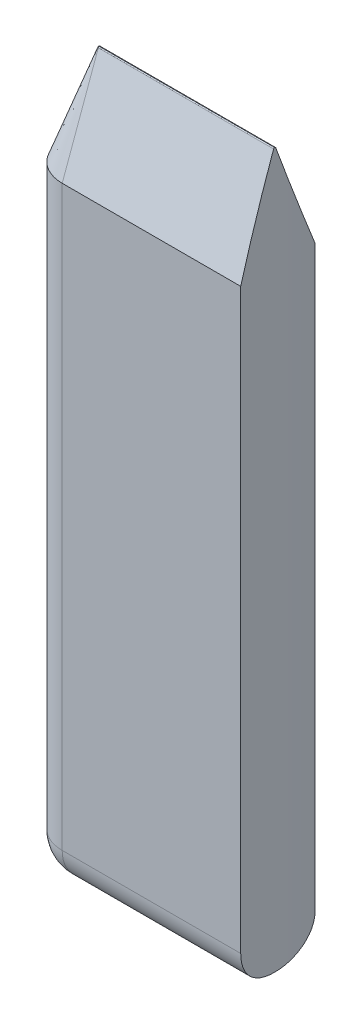
ISO-10303-21;
HEADER;
FILE_DESCRIPTION(('STEP AP214'),'2;1');
FILE_NAME('part.step','',(''),(''),'','','');
FILE_SCHEMA(('AUTOMOTIVE_DESIGN { 1 0 10303 214 1 1 1 1 }'));
ENDSEC;
DATA;
#1=APPLICATION_CONTEXT('core data for automotive mechanical design processes');
#2=APPLICATION_PROTOCOL_DEFINITION('international standard','automotive_design',2000,#1);
#3=PRODUCT_CONTEXT('',#1,'mechanical');
#4=PRODUCT('Part','Part','',(#3));
#5=PRODUCT_RELATED_PRODUCT_CATEGORY('part','',(#4));
#6=PRODUCT_DEFINITION_FORMATION('','',#4);
#7=PRODUCT_DEFINITION_CONTEXT('part definition',#1,'design');
#8=PRODUCT_DEFINITION('design','',#6,#7);
#9=PRODUCT_DEFINITION_SHAPE('','',#8);
#10=(LENGTH_UNIT() NAMED_UNIT(*) SI_UNIT(.MILLI.,.METRE.));
#11=(NAMED_UNIT(*) PLANE_ANGLE_UNIT() SI_UNIT($,.RADIAN.));
#12=(NAMED_UNIT(*) SI_UNIT($,.STERADIAN.) SOLID_ANGLE_UNIT());
#13=UNCERTAINTY_MEASURE_WITH_UNIT(LENGTH_MEASURE(1.E-05),#10,'distance_accuracy_value','');
#14=(GEOMETRIC_REPRESENTATION_CONTEXT(3) GLOBAL_UNCERTAINTY_ASSIGNED_CONTEXT((#13)) GLOBAL_UNIT_ASSIGNED_CONTEXT((#10,
#11,#12)) REPRESENTATION_CONTEXT('',''));
#15=CARTESIAN_POINT('',(0.,0.,0.));
#16=DIRECTION('',(0.,0.,1.));
#17=DIRECTION('',(1.,0.,0.));
#18=AXIS2_PLACEMENT_3D('',#15,#16,#17);
#19=CARTESIAN_POINT('',(0.,100.,-5.20944533000771));
#20=DIRECTION('',(0.,0.,1.));
#21=DIRECTION('',(1.,0.,0.));
#22=AXIS2_PLACEMENT_3D('',#19,#20,#21);
#23=PLANE('',#22);
#24=DIRECTION('',(0.,-1.,0.));
#25=VECTOR('',#24,1.);
#26=CARTESIAN_POINT('',(-29.5442325903663,100.,-5.2094453300077));
#27=LINE('',#26,#25);
#28=CARTESIAN_POINT('',(-29.5442325903663,85.9999999999999,-5.2094453300077));
#29=VERTEX_POINT('',#28);
#30=CARTESIAN_POINT('',(-29.5442325903663,5.09999999999999,-5.2094453300077));
#31=VERTEX_POINT('',#30);
#32=EDGE_CURVE('E125',#29,#31,#27,.T.);
#33=ORIENTED_EDGE('',*,*,#32,.T.);
#34=DIRECTION('',(-1.,0.,0.));
#35=VECTOR('',#34,1.);
#36=CARTESIAN_POINT('',(0.,5.09999999999999,-5.20944533000771));
#37=LINE('',#36,#35);
#38=CARTESIAN_POINT('',(-54.5442325903663,5.09999999999999,-5.2094453300077));
#39=VERTEX_POINT('',#38);
#40=EDGE_CURVE('E11',#31,#39,#37,.T.);
#41=ORIENTED_EDGE('',*,*,#40,.T.);
#42=DIRECTION('',(0.,-1.,0.));
#43=VECTOR('',#42,1.);
#44=CARTESIAN_POINT('',(-54.5442325903663,100.,-5.2094453300077));
#45=LINE('',#44,#43);
#46=CARTESIAN_POINT('',(-54.5442325903663,85.9999999999999,-5.2094453300077));
#47=VERTEX_POINT('',#46);
#48=EDGE_CURVE('E126',#47,#39,#45,.T.);
#49=ORIENTED_EDGE('',*,*,#48,.F.);
#50=DIRECTION('',(1.,0.,0.));
#51=VECTOR('',#50,1.);
#52=CARTESIAN_POINT('',(-29.5442325903663,85.9999999999999,-5.2094453300077));
#53=LINE('',#52,#51);
#54=EDGE_CURVE('E123',#47,#29,#53,.T.);
#55=ORIENTED_EDGE('',*,*,#54,.T.);
#56=EDGE_LOOP('',(#33,#41,#49,#55));
#57=FACE_BOUND('',#56,.T.);
#58=ADVANCED_FACE('F43',(#57),#23,.F.);
#59=CARTESIAN_POINT('',(-54.5442325903663,100.,2.19442519711066E-13));
#60=DIRECTION('',(0.,-1.,0.));
#61=DIRECTION('',(0.,0.,-1.));
#62=AXIS2_PLACEMENT_3D('',#59,#60,#61);
#63=CYLINDRICAL_SURFACE('',#62,5.20944533000792);
#64=ORIENTED_EDGE('',*,*,#48,.T.);
#65=CARTESIAN_POINT('',(-54.5442325903663,5.09999999999999,2.19442519711066E-13));
#66=DIRECTION('',(0.,1.,0.));
#67=DIRECTION('',(0.,0.,1.));
#68=AXIS2_PLACEMENT_3D('',#65,#66,#67);
#69=CIRCLE('',#68,5.20944533000792);
#70=CARTESIAN_POINT('',(-54.5442325903663,5.09999999999999,5.20944533000814));
#71=VERTEX_POINT('',#70);
#72=EDGE_CURVE('E54',#39,#71,#69,.T.);
#73=ORIENTED_EDGE('',*,*,#72,.T.);
#74=DIRECTION('',(0.,-1.,0.));
#75=VECTOR('',#74,1.);
#76=CARTESIAN_POINT('',(-54.5442325903663,100.,5.20944533000814));
#77=LINE('',#76,#75);
#78=CARTESIAN_POINT('',(-54.5442325903663,85.9999999999999,5.20944533000814));
#79=VERTEX_POINT('',#78);
#80=EDGE_CURVE('E157',#79,#71,#77,.T.);
#81=ORIENTED_EDGE('',*,*,#80,.F.);
#82=CARTESIAN_POINT('',(-54.5442325903663,85.9999999999999,2.19442519711066E-13));
#83=DIRECTION('',(0.,1.,0.));
#84=DIRECTION('',(0.,0.,1.));
#85=AXIS2_PLACEMENT_3D('',#82,#83,#84);
#86=CIRCLE('',#85,5.20944533000792);
#87=EDGE_CURVE('E132',#79,#47,#86,.F.);
#88=ORIENTED_EDGE('',*,*,#87,.T.);
#89=EDGE_LOOP('',(#64,#73,#81,#88));
#90=FACE_BOUND('',#89,.T.);
#91=ADVANCED_FACE('F299',(#90),#63,.T.);
#92=CARTESIAN_POINT('',(0.,100.,5.20944533000814));
#93=DIRECTION('',(0.,0.,-1.));
#94=DIRECTION('',(-1.,0.,0.));
#95=AXIS2_PLACEMENT_3D('',#92,#93,#94);
#96=PLANE('',#95);
#97=ORIENTED_EDGE('',*,*,#80,.T.);
#98=DIRECTION('',(1.,0.,0.));
#99=VECTOR('',#98,1.);
#100=CARTESIAN_POINT('',(0.,5.09999999999999,5.20944533000814));
#101=LINE('',#100,#99);
#102=CARTESIAN_POINT('',(-29.5442325903662,5.09999999999999,5.20944533000814));
#103=VERTEX_POINT('',#102);
#104=EDGE_CURVE('E263',#71,#103,#101,.T.);
#105=ORIENTED_EDGE('',*,*,#104,.T.);
#106=DIRECTION('',(0.,-1.,0.));
#107=VECTOR('',#106,1.);
#108=CARTESIAN_POINT('',(-29.5442325903662,100.,5.20944533000814));
#109=LINE('',#108,#107);
#110=CARTESIAN_POINT('',(-29.5442325903662,85.9999999999999,5.20944533000814));
#111=VERTEX_POINT('',#110);
#112=EDGE_CURVE('E144',#111,#103,#109,.T.);
#113=ORIENTED_EDGE('',*,*,#112,.F.);
#114=DIRECTION('',(-1.,0.,0.));
#115=VECTOR('',#114,1.);
#116=CARTESIAN_POINT('',(-54.5442325903663,85.9999999999999,5.20944533000814));
#117=LINE('',#116,#115);
#118=EDGE_CURVE('E155',#111,#79,#117,.T.);
#119=ORIENTED_EDGE('',*,*,#118,.T.);
#120=EDGE_LOOP('',(#97,#105,#113,#119));
#121=FACE_BOUND('',#120,.T.);
#122=ADVANCED_FACE('F304',(#121),#96,.F.);
#123=CARTESIAN_POINT('',(0.,100.,0.));
#124=DIRECTION('',(0.,-1.,0.));
#125=DIRECTION('',(0.,0.,-1.));
#126=AXIS2_PLACEMENT_3D('',#123,#124,#125);
#127=CYLINDRICAL_SURFACE('',#126,30.);
#128=ORIENTED_EDGE('',*,*,#112,.T.);
#129=CARTESIAN_POINT('',(-29.5442325903662,5.09999999999999,5.20944533000814));
#130=CARTESIAN_POINT('',(-29.5442218325108,4.9577174742323,5.2094619453206));
#131=CARTESIAN_POINT('',(-29.5452821125208,4.81543877875373,5.20349183932434));
#132=CARTESIAN_POINT('',(-29.549466738831,4.53192074410002,5.17969929964654));
#133=CARTESIAN_POINT('',(-29.5525908700081,4.3906812981511,5.16187810124962));
#134=CARTESIAN_POINT('',(-29.5608195584034,4.11043617542221,5.11453701388363));
#135=CARTESIAN_POINT('',(-29.5659213866775,3.97142769428515,5.08503324402277));
#136=CARTESIAN_POINT('',(-29.577956073752,3.69643079101989,5.01455877518684));
#137=CARTESIAN_POINT('',(-29.58488893216,3.5604423682444,4.97358807866953));
#138=CARTESIAN_POINT('',(-29.6003897453926,3.29243515995644,4.88048660443796));
#139=CARTESIAN_POINT('',(-29.6089577335196,3.16041645535807,4.82835559942067));
#140=CARTESIAN_POINT('',(-29.6274909261284,2.90121498667138,4.71329783142563));
#141=CARTESIAN_POINT('',(-29.6374566452518,2.77403402585634,4.65036709008976));
#142=CARTESIAN_POINT('',(-29.6585022261715,2.52546590176804,4.5141984490243));
#143=CARTESIAN_POINT('',(-29.6695817319161,2.40407690512149,4.44096384022972));
#144=CARTESIAN_POINT('',(-29.6925566863038,2.16782573751628,4.28466063123084));
#145=CARTESIAN_POINT('',(-29.7044524205444,2.05296587706432,4.20158858145978));
#146=CARTESIAN_POINT('',(-29.7288442800312,1.82956121045432,4.02539409242482));
#147=CARTESIAN_POINT('',(-29.7413449318481,1.721084441918,3.93218600113604));
#148=CARTESIAN_POINT('',(-29.7664995492098,1.5123476137697,3.73700204068212));
#149=CARTESIAN_POINT('',(-29.7791535155875,1.41208759882309,3.63502612386222));
#150=CARTESIAN_POINT('',(-29.8042733454019,1.2204359284725,3.42296534237359));
#151=CARTESIAN_POINT('',(-29.8167391381917,1.12904753712346,3.31287751917298));
#152=CARTESIAN_POINT('',(-29.8411340302005,0.955844851381717,3.08541670883883));
#153=CARTESIAN_POINT('',(-29.8530633143957,0.874027241375479,2.96804626632305));
#154=CARTESIAN_POINT('',(-29.8761511016307,0.719937533184893,2.72589314236945));
#155=CARTESIAN_POINT('',(-29.8873032506017,0.64774051851732,2.60106205529978));
#156=CARTESIAN_POINT('',(-29.9084281473089,0.514163299124288,2.34570523169869));
#157=CARTESIAN_POINT('',(-29.9184013296827,0.452779104032281,2.2151816182181));
#158=CARTESIAN_POINT('',(-29.9368960035573,0.341272623658434,1.94935691070488));
#159=CARTESIAN_POINT('',(-29.9454180059798,0.291146372765552,1.81405751843492));
#160=CARTESIAN_POINT('',(-29.9607797685641,0.202524937433703,1.5396670063071));
#161=CARTESIAN_POINT('',(-29.9676199373074,0.164026927531619,1.40057681651759));
#162=CARTESIAN_POINT('',(-29.9814470220937,0.0878512704453816,1.07159214291683));
#163=CARTESIAN_POINT('',(-29.9876900942969,0.0549209829009383,0.880532352718219));
#164=CARTESIAN_POINT('',(-29.994308612837,0.0219789119984413,0.592221230109305));
#165=CARTESIAN_POINT('',(-29.9960569805275,0.0137404558155837,0.495862461108339));
#166=CARTESIAN_POINT('',(-29.9986269127672,0.00275162314080604,0.302826804598548));
#167=CARTESIAN_POINT('',(-29.9994485408976,8.70141480275351E-07,0.206149939369973));
#168=CARTESIAN_POINT('',(-29.9998003613314,0.,0.109445330008141));
#169=B_SPLINE_CURVE_WITH_KNOTS('',3,(#129,#130,#131,#132,#133,#134,#135,#136,#137,#138,#139,
#140,#141,#142,#143,#144,#145,#146,#147,#148,#149,#150,#151,#152,#153,#154,#155,#156,#157,#158,
#159,#160,#161,#162,#163,#164,#165,#166,#167,#168),.UNSPECIFIED.,.F.,.F.,(4,2,2,2,2,2,2,2,2,2,2,
2,2,2,2,2,2,2,2,4),(0.,0.426712728252777,0.853380985577793,1.27946258438274,1.70554409186355,
2.13163427821183,2.55788176399363,2.9839934190473,3.41025493803148,3.8404490530832,
4.2706455064672,4.70099964292111,5.13120424712493,5.56459102140884,5.99781752188233,
6.43089117813037,6.86385952009873,7.44432654293333,7.73437010370512,8.02439376411038),.UNSPECIFIED.);
#170=CARTESIAN_POINT('',(-29.9998003613314,0.,0.109445330008139));
#171=VERTEX_POINT('',#170);
#172=EDGE_CURVE('E219',#103,#171,#169,.T.);
#173=ORIENTED_EDGE('',*,*,#172,.T.);
#174=CARTESIAN_POINT('',(0.,0.,0.));
#175=DIRECTION('',(0.,1.,0.));
#176=DIRECTION('',(0.,0.,1.));
#177=AXIS2_PLACEMENT_3D('',#174,#175,#176);
#178=CIRCLE('',#177,30.);
#179=CARTESIAN_POINT('',(-29.9998003613314,0.,-0.109445330007705));
#180=VERTEX_POINT('',#179);
#181=EDGE_CURVE('E174',#180,#171,#178,.T.);
#182=ORIENTED_EDGE('',*,*,#181,.F.);
#183=CARTESIAN_POINT('',(-29.9998003613314,0.,-0.109445330007705));
#184=CARTESIAN_POINT('',(-29.9992909401964,-1.65254190717098E-05,-0.251855665726624));
#185=CARTESIAN_POINT('',(-29.9977476020564,0.00596419409722868,-0.394258369641108));
#186=CARTESIAN_POINT('',(-29.992670178993,0.0297977857413274,-0.67801700959861));
#187=CARTESIAN_POINT('',(-29.9891362974598,0.0476494449510309,-0.819373051092931));
#188=CARTESIAN_POINT('',(-29.9801607791786,0.0950707140583756,-1.09984763665828));
#189=CARTESIAN_POINT('',(-29.9747217146443,0.124624531693326,-1.23896893434017));
#190=CARTESIAN_POINT('',(-29.9620796122686,0.195217637693757,-1.51418320432871));
#191=CARTESIAN_POINT('',(-29.9548765753155,0.236256920275695,-1.65027617816024));
#192=CARTESIAN_POINT('',(-29.9388955966588,0.329514062067432,-1.91848481299129));
#193=CARTESIAN_POINT('',(-29.930117606993,0.381732261719539,-2.05060035272237));
#194=CARTESIAN_POINT('',(-29.9112167295176,0.496982157714836,-2.30998502423049));
#195=CARTESIAN_POINT('',(-29.9010933465608,0.560017837731348,-2.43725234941727));
#196=CARTESIAN_POINT('',(-29.8797772782473,0.696412692491037,-2.68597976906648));
#197=CARTESIAN_POINT('',(-29.8685849439679,0.769768481503683,-2.8074417506561));
#198=CARTESIAN_POINT('',(-29.8454224765661,0.926329814032865,-3.04382458961479));
#199=CARTESIAN_POINT('',(-29.8334520714422,1.0095388105248,-3.15874313287328));
#200=CARTESIAN_POINT('',(-29.8089492283203,1.18598594231188,-3.38220238070389));
#201=CARTESIAN_POINT('',(-29.7964127694212,1.27930593908105,-3.49067801317504));
#202=CARTESIAN_POINT('',(-29.7712191051377,1.47471956465638,-3.69940076659518));
#203=CARTESIAN_POINT('',(-29.7585618991593,1.57681323663289,-3.79964784705133));
#204=CARTESIAN_POINT('',(-29.7334689871696,1.78911475723911,-3.99126102594164));
#205=CARTESIAN_POINT('',(-29.7210333647576,1.89932559105435,-4.08262382812333));
#206=CARTESIAN_POINT('',(-29.6967361553563,2.12703602948195,-4.2557612226739));
#207=CARTESIAN_POINT('',(-29.6848743698717,2.24453308116801,-4.33753914466739));
#208=CARTESIAN_POINT('',(-29.6619725800038,2.48687345566946,-4.49149010150039));
#209=CARTESIAN_POINT('',(-29.6509387361704,2.61176143998997,-4.56359378064336));
#210=CARTESIAN_POINT('',(-29.6301017667406,2.86722633371635,-4.69698054784637));
#211=CARTESIAN_POINT('',(-29.6202981859573,2.99780111482538,-4.75826764138209));
#212=CARTESIAN_POINT('',(-29.6022029326121,3.26372006013375,-4.8695753807062));
#213=CARTESIAN_POINT('',(-29.5939107103002,3.39906246866777,-4.91960012468842));
#214=CARTESIAN_POINT('',(-29.5790768924416,3.67353076690956,-5.00801480392936));
#215=CARTESIAN_POINT('',(-29.5725348677222,3.8126557198503,-5.04640759181073));
#216=CARTESIAN_POINT('',(-29.5595194279071,4.14107315558337,-5.12218625415215));
#217=CARTESIAN_POINT('',(-29.5538082870597,4.33150893982478,-5.15489549298873));
#218=CARTESIAN_POINT('',(-29.5480751839355,4.6188606739643,-5.18761552690795));
#219=CARTESIAN_POINT('',(-29.5466364253479,4.71489599503232,-5.19579822716794));
#220=CARTESIAN_POINT('',(-29.544714633877,4.90727897140723,-5.20671252747314));
#221=CARTESIAN_POINT('',(-29.5442315368755,5.00362660532567,-5.20944449322428));
#222=CARTESIAN_POINT('',(-29.5442325903663,5.09999999999999,-5.2094453300077));
#223=B_SPLINE_CURVE_WITH_KNOTS('',3,(#183,#184,#185,#186,#187,#188,#189,#190,#191,#192,#193,
#194,#195,#196,#197,#198,#199,#200,#201,#202,#203,#204,#205,#206,#207,#208,#209,#210,#211,#212,
#213,#214,#215,#216,#217,#218,#219,#220,#221,#222),.UNSPECIFIED.,.F.,.F.,(4,2,2,2,2,2,2,2,2,2,2,
2,2,2,2,2,2,2,2,4),(0.,0.427098804861374,0.854153977432398,1.28063478529898,1.70711537841021,
2.13360896139303,2.56025994438086,2.98677128046827,3.4134325287593,3.84385082508393,
4.27427123937711,4.70485074413717,5.13528022676222,5.56864711258198,6.00185318061568,
6.43490135599194,6.8678432444445,7.44631691237875,7.73536525273406,8.02439419932722),.UNSPECIFIED.);
#224=EDGE_CURVE('E142',#180,#31,#223,.T.);
#225=ORIENTED_EDGE('',*,*,#224,.T.);
#226=ORIENTED_EDGE('',*,*,#32,.F.);
#227=CARTESIAN_POINT('',(0.,100.312833412079,0.));
#228=DIRECTION('',(0.,0.342020143325666,-0.939692620785909));
#229=DIRECTION('',(0.,-0.939692620785909,-0.342020143325666));
#230=AXIS2_PLACEMENT_3D('',#227,#228,#229);
#231=ELLIPSE('',#230,87.7141320048932,30.);
#232=CARTESIAN_POINT('',(-29.9996260728345,99.9013030214989,-0.149784812667292));
#233=VERTEX_POINT('',#232);
#234=EDGE_CURVE('E138',#29,#233,#231,.T.);
#235=ORIENTED_EDGE('',*,*,#234,.T.);
#236=CARTESIAN_POINT('',(-29.9996260728345,99.9013030214989,-0.149784812667294));
#237=CARTESIAN_POINT('',(-29.9996404036884,99.9092349175894,-0.146905482667805));
#238=CARTESIAN_POINT('',(-29.9996578161423,99.9169165091503,-0.143344678941403));
#239=CARTESIAN_POINT('',(-29.9996965870593,99.9315716215033,-0.134991815411371));
#240=CARTESIAN_POINT('',(-29.9997179428105,99.9385456238379,-0.130200600898598));
#241=CARTESIAN_POINT('',(-29.9997624177129,99.9515921318218,-0.119512167977807));
#242=CARTESIAN_POINT('',(-29.999785537567,99.9576642752809,-0.113614507357039));
#243=CARTESIAN_POINT('',(-29.9998310466726,99.9687318425656,-0.100884314640802));
#244=CARTESIAN_POINT('',(-29.9998534360084,99.9737273911216,-0.0940518909936573));
#245=CARTESIAN_POINT('',(-29.9998951443222,99.9825016932101,-0.0796440994051266));
#246=CARTESIAN_POINT('',(-29.9999144624305,99.986280102378,-0.0720685219930863));
#247=CARTESIAN_POINT('',(-29.9999480227497,99.9925100523478,-0.0563906533110948));
#248=CARTESIAN_POINT('',(-29.9999622672004,99.9949621789003,-0.0482885963338741));
#249=CARTESIAN_POINT('',(-29.9999801256876,99.9978084643646,-0.0349125292666395));
#250=CARTESIAN_POINT('',(-29.9999857227793,99.9986300674486,-0.029725600830425));
#251=CARTESIAN_POINT('',(-29.9999942451135,99.9997255852973,-0.0193034901910599));
#252=CARTESIAN_POINT('',(-29.9999971750538,100.000000464041,-0.0140684092982567));
#253=CARTESIAN_POINT('',(-29.9999987002476,100.,-0.00883091954947934));
#254=B_SPLINE_CURVE_WITH_KNOTS('',3,(#236,#237,#238,#239,#240,#241,#242,#243,#244,#245,#246,
#247,#248,#249,#250,#251,#252,#253),.UNSPECIFIED.,.F.,.F.,(4,2,2,2,2,2,2,2,4),(0.,
0.0252814395558958,0.0505455570384574,0.0758197934121855,0.101091100029585,0.12636955037846,
0.151636827405368,0.167365126628323,0.183065669183973),.UNSPECIFIED.);
#255=CARTESIAN_POINT('',(-29.9999987002476,100.,-0.00883091954940816));
#256=VERTEX_POINT('',#255);
#257=EDGE_CURVE('E195',#233,#256,#254,.T.);
#258=ORIENTED_EDGE('',*,*,#257,.T.);
#259=CARTESIAN_POINT('',(0.,100.,0.));
#260=DIRECTION('',(0.,1.,0.));
#261=DIRECTION('',(0.,0.,1.));
#262=AXIS2_PLACEMENT_3D('',#259,#260,#261);
#263=CIRCLE('',#262,30.);
#264=CARTESIAN_POINT('',(-29.9999987002476,100.,0.00883091954984271));
#265=VERTEX_POINT('',#264);
#266=EDGE_CURVE('E145',#256,#265,#263,.T.);
#267=ORIENTED_EDGE('',*,*,#266,.T.);
#268=CARTESIAN_POINT('',(-29.9999987002476,100.,0.00883091954984271));
#269=CARTESIAN_POINT('',(-29.9999963536081,100.00000718376,0.017269186525276));
#270=CARTESIAN_POINT('',(-29.9999901766691,99.999288392332,0.0257053263862148));
#271=CARTESIAN_POINT('',(-29.9999712461609,99.9964516533085,0.0423333550316571));
#272=CARTESIAN_POINT('',(-29.9999584971036,99.9943346653013,0.0505254073074347));
#273=CARTESIAN_POINT('',(-29.9999274939456,99.9887530768892,0.0664406631192918));
#274=CARTESIAN_POINT('',(-29.9999092376422,99.9852879370548,0.0741636775497169));
#275=CARTESIAN_POINT('',(-29.9998691325569,99.9771109299529,0.0889176740159169));
#276=CARTESIAN_POINT('',(-29.9998472841912,99.9723992071017,0.0959487360848981));
#277=CARTESIAN_POINT('',(-29.9998022661155,99.9618614540761,0.109121594429699));
#278=CARTESIAN_POINT('',(-29.9997790960276,99.956035104144,0.115263134634227));
#279=CARTESIAN_POINT('',(-29.9997339060361,99.9434336503441,0.126479529314726));
#280=CARTESIAN_POINT('',(-29.9997118856288,99.9366589668759,0.131554853968114));
#281=CARTESIAN_POINT('',(-29.9996790162692,99.9250630047177,0.138804531568994));
#282=CARTESIAN_POINT('',(-29.9996670881169,99.9204697380504,0.141350739505511));
#283=CARTESIAN_POINT('',(-29.9996450844331,99.9110505197692,0.145944965793604));
#284=CARTESIAN_POINT('',(-29.9996350056694,99.9062249930909,0.147993855395129));
#285=CARTESIAN_POINT('',(-29.9996260728346,99.901303021499,0.149784812668019));
#286=B_SPLINE_CURVE_WITH_KNOTS('',3,(#268,#269,#270,#271,#272,#273,#274,#275,#276,#277,#278,
#279,#280,#281,#282,#283,#284,#285),.UNSPECIFIED.,.F.,.F.,(4,2,2,2,2,2,2,2,4),(0.,
0.0252812062818956,0.0505450799728739,0.0758190727872966,0.101090138894662,0.12636846551728,
0.151635621449977,0.167364525198137,0.18306567137486),.UNSPECIFIED.);
#287=CARTESIAN_POINT('',(-29.9996260728345,99.9013030214989,0.149784812667717));
#288=VERTEX_POINT('',#287);
#289=EDGE_CURVE('E186',#265,#288,#286,.T.);
#290=ORIENTED_EDGE('',*,*,#289,.T.);
#291=CARTESIAN_POINT('',(0.,100.312833412081,0.));
#292=DIRECTION('',(0.,0.342020143325666,0.939692620785909));
#293=DIRECTION('',(0.,-0.939692620785909,0.342020143325666));
#294=AXIS2_PLACEMENT_3D('',#291,#292,#293);
#295=ELLIPSE('',#294,87.7141320048932,30.);
#296=EDGE_CURVE('E151',#288,#111,#295,.T.);
#297=ORIENTED_EDGE('',*,*,#296,.T.);
#298=EDGE_LOOP('',(#128,#173,#182,#225,#226,#235,#258,#267,#290,#297));
#299=FACE_BOUND('',#298,.T.);
#300=ADVANCED_FACE('F137',(#299),#127,.F.);
#301=CARTESIAN_POINT('',(0.,100.,0.));
#302=DIRECTION('',(0.,1.,0.));
#303=DIRECTION('',(0.,0.,1.));
#304=AXIS2_PLACEMENT_3D('',#301,#302,#303);
#305=PLANE('',#304);
#306=ORIENTED_EDGE('',*,*,#266,.F.);
#307=DIRECTION('',(-1.,0.,0.));
#308=VECTOR('',#307,1.);
#309=CARTESIAN_POINT('',(0.,100.,-0.00883091954941336));
#310=LINE('',#309,#308);
#311=CARTESIAN_POINT('',(-54.5442325903663,100.,-0.00883091954940309));
#312=VERTEX_POINT('',#311);
#313=EDGE_CURVE('E180',#256,#312,#310,.T.);
#314=ORIENTED_EDGE('',*,*,#313,.T.);
#315=CARTESIAN_POINT('',(-54.5442325903663,100.,2.19442519711066E-13));
#316=DIRECTION('',(0.,1.,0.));
#317=DIRECTION('',(0.,0.,1.));
#318=AXIS2_PLACEMENT_3D('',#315,#316,#317);
#319=CIRCLE('',#318,0.00883091954962253);
#320=CARTESIAN_POINT('',(-54.5442325903663,100.,0.00883091954984271));
#321=VERTEX_POINT('',#320);
#322=EDGE_CURVE('E177',#312,#321,#319,.T.);
#323=ORIENTED_EDGE('',*,*,#322,.T.);
#324=DIRECTION('',(1.,0.,0.));
#325=VECTOR('',#324,1.);
#326=CARTESIAN_POINT('',(0.,100.,0.00883091954984271));
#327=LINE('',#326,#325);
#328=EDGE_CURVE('E131',#321,#265,#327,.T.);
#329=ORIENTED_EDGE('',*,*,#328,.T.);
#330=EDGE_LOOP('',(#306,#314,#323,#329));
#331=FACE_BOUND('',#330,.T.);
#332=ADVANCED_FACE('F284',(#331),#305,.T.);
#333=CARTESIAN_POINT('',(0.,0.,0.));
#334=DIRECTION('',(0.,1.,0.));
#335=DIRECTION('',(0.,0.,1.));
#336=AXIS2_PLACEMENT_3D('',#333,#334,#335);
#337=PLANE('',#336);
#338=ORIENTED_EDGE('',*,*,#181,.T.);
#339=DIRECTION('',(1.,0.,0.));
#340=VECTOR('',#339,1.);
#341=CARTESIAN_POINT('',(0.,0.,0.109445330008139));
#342=LINE('',#341,#340);
#343=CARTESIAN_POINT('',(-54.5442325903663,0.,0.109445330008139));
#344=VERTEX_POINT('',#343);
#345=EDGE_CURVE('E68',#171,#344,#342,.F.);
#346=ORIENTED_EDGE('',*,*,#345,.T.);
#347=CARTESIAN_POINT('',(-54.5442325903663,0.,2.19442519711066E-13));
#348=DIRECTION('',(0.,1.,0.));
#349=DIRECTION('',(0.,0.,1.));
#350=AXIS2_PLACEMENT_3D('',#347,#348,#349);
#351=CIRCLE('',#350,0.10944533000792);
#352=CARTESIAN_POINT('',(-54.5442325903663,0.,-0.109445330007701));
#353=VERTEX_POINT('',#352);
#354=EDGE_CURVE('E235',#344,#353,#351,.F.);
#355=ORIENTED_EDGE('',*,*,#354,.T.);
#356=DIRECTION('',(-1.,0.,0.));
#357=VECTOR('',#356,1.);
#358=CARTESIAN_POINT('',(0.,0.,-0.10944533000771));
#359=LINE('',#358,#357);
#360=EDGE_CURVE('E227',#353,#180,#359,.F.);
#361=ORIENTED_EDGE('',*,*,#360,.T.);
#362=EDGE_LOOP('',(#338,#346,#355,#361));
#363=FACE_BOUND('',#362,.T.);
#364=ADVANCED_FACE('F322',(#363),#337,.F.);
#365=CARTESIAN_POINT('',(0.,100.,-0.11386205028087));
#366=DIRECTION('',(0.,0.342020143325666,-0.939692620785909));
#367=DIRECTION('',(1.,0.,0.));
#368=AXIS2_PLACEMENT_3D('',#365,#366,#367);
#369=PLANE('',#368);
#370=DIRECTION('',(0.,-0.939692620785909,-0.342020143325666));
#371=VECTOR('',#370,1.);
#372=CARTESIAN_POINT('',(-54.5442325903663,100.,-0.11386205028086));
#373=LINE('',#372,#371);
#374=CARTESIAN_POINT('',(-54.5442325903663,99.9013030214989,-0.14978481266729));
#375=VERTEX_POINT('',#374);
#376=EDGE_CURVE('E170',#375,#47,#373,.T.);
#377=ORIENTED_EDGE('',*,*,#376,.F.);
#378=DIRECTION('',(-1.,0.,0.));
#379=VECTOR('',#378,1.);
#380=CARTESIAN_POINT('',(0.,99.9013030214989,-0.1497848126673));
#381=LINE('',#380,#379);
#382=EDGE_CURVE('E149',#375,#233,#381,.F.);
#383=ORIENTED_EDGE('',*,*,#382,.T.);
#384=ORIENTED_EDGE('',*,*,#234,.F.);
#385=ORIENTED_EDGE('',*,*,#54,.F.);
#386=EDGE_LOOP('',(#377,#383,#384,#385));
#387=FACE_BOUND('',#386,.T.);
#388=ADVANCED_FACE('F147',(#387),#369,.T.);
#389=CARTESIAN_POINT('',(-54.5442325903663,100.,2.19442519711066E-13));
#390=DIRECTION('',(0.,-1.,0.));
#391=DIRECTION('',(0.,0.,-1.));
#392=AXIS2_PLACEMENT_3D('',#389,#390,#391);
#393=CONICAL_SURFACE('',#392,0.11386205028108,0.349065850398863);
#394=DIRECTION('',(0.,-0.939692620785909,0.342020143325666));
#395=VECTOR('',#394,1.);
#396=CARTESIAN_POINT('',(-54.5442325903663,100.,0.113862050281299));
#397=LINE('',#396,#395);
#398=CARTESIAN_POINT('',(-54.5442325903663,99.9013030214989,0.149784812667729));
#399=VERTEX_POINT('',#398);
#400=EDGE_CURVE('E167',#399,#79,#397,.T.);
#401=ORIENTED_EDGE('',*,*,#400,.F.);
#402=CARTESIAN_POINT('',(-54.5442325903663,99.9013030214989,2.19442519711066E-13));
#403=DIRECTION('',(0.,1.,0.));
#404=DIRECTION('',(0.,0.,1.));
#405=AXIS2_PLACEMENT_3D('',#402,#403,#404);
#406=CIRCLE('',#405,0.149784812667511);
#407=EDGE_CURVE('E271',#399,#375,#406,.F.);
#408=ORIENTED_EDGE('',*,*,#407,.T.);
#409=ORIENTED_EDGE('',*,*,#376,.T.);
#410=ORIENTED_EDGE('',*,*,#87,.F.);
#411=EDGE_LOOP('',(#401,#408,#409,#410));
#412=FACE_BOUND('',#411,.T.);
#413=ADVANCED_FACE('F314',(#412),#393,.T.);
#414=CARTESIAN_POINT('',(0.,100.,0.113862050281299));
#415=DIRECTION('',(0.,0.342020143325666,0.939692620785909));
#416=DIRECTION('',(-1.,0.,0.));
#417=AXIS2_PLACEMENT_3D('',#414,#415,#416);
#418=PLANE('',#417);
#419=ORIENTED_EDGE('',*,*,#296,.F.);
#420=DIRECTION('',(1.,0.,0.));
#421=VECTOR('',#420,1.);
#422=CARTESIAN_POINT('',(0.,99.9013030214989,0.149784812667729));
#423=LINE('',#422,#421);
#424=EDGE_CURVE('E262',#288,#399,#423,.F.);
#425=ORIENTED_EDGE('',*,*,#424,.T.);
#426=ORIENTED_EDGE('',*,*,#400,.T.);
#427=ORIENTED_EDGE('',*,*,#118,.F.);
#428=EDGE_LOOP('',(#419,#425,#426,#427));
#429=FACE_BOUND('',#428,.T.);
#430=ADVANCED_FACE('F211',(#429),#418,.T.);
#431=CARTESIAN_POINT('',(0.,99.85,0.00883091954984271));
#432=DIRECTION('',(1.,0.,0.));
#433=DIRECTION('',(0.,0.,-1.));
#434=AXIS2_PLACEMENT_3D('',#431,#432,#433);
#435=CYLINDRICAL_SURFACE('',#434,0.15);
#436=ORIENTED_EDGE('',*,*,#289,.F.);
#437=ORIENTED_EDGE('',*,*,#328,.F.);
#438=CARTESIAN_POINT('',(-54.5442325903663,99.85,0.00883091954984256));
#439=DIRECTION('',(-1.,0.,0.));
#440=DIRECTION('',(0.,0.,1.));
#441=AXIS2_PLACEMENT_3D('',#438,#439,#440);
#442=CIRCLE('',#441,0.15);
#443=EDGE_CURVE('E171',#399,#321,#442,.T.);
#444=ORIENTED_EDGE('',*,*,#443,.F.);
#445=ORIENTED_EDGE('',*,*,#424,.F.);
#446=EDGE_LOOP('',(#436,#437,#444,#445));
#447=FACE_BOUND('',#446,.T.);
#448=ADVANCED_FACE('F205',(#447),#435,.T.);
#449=CARTESIAN_POINT('',(-54.5442325903663,99.85,2.19442519711066E-13));
#450=DIRECTION('',(0.,1.,0.));
#451=DIRECTION('',(0.,0.,1.));
#452=AXIS2_PLACEMENT_3D('',#449,#450,#451);
#453=DEGENERATE_TOROIDAL_SURFACE('',#452,0.00883091954962253,0.15,.T.);
#454=ORIENTED_EDGE('',*,*,#443,.T.);
#455=ORIENTED_EDGE('',*,*,#322,.F.);
#456=CARTESIAN_POINT('',(-54.5442325903663,99.85,-0.00883091954940272));
#457=DIRECTION('',(1.,0.,0.));
#458=DIRECTION('',(0.,0.,-1.));
#459=AXIS2_PLACEMENT_3D('',#456,#457,#458);
#460=CIRCLE('',#459,0.15);
#461=EDGE_CURVE('E248',#375,#312,#460,.T.);
#462=ORIENTED_EDGE('',*,*,#461,.F.);
#463=ORIENTED_EDGE('',*,*,#407,.F.);
#464=EDGE_LOOP('',(#454,#455,#462,#463));
#465=FACE_BOUND('',#464,.T.);
#466=ADVANCED_FACE('F210',(#465),#453,.T.);
#467=CARTESIAN_POINT('',(0.,99.85,-0.00883091954941336));
#468=DIRECTION('',(-1.,0.,0.));
#469=DIRECTION('',(0.,0.,1.));
#470=AXIS2_PLACEMENT_3D('',#467,#468,#469);
#471=CYLINDRICAL_SURFACE('',#470,0.15);
#472=ORIENTED_EDGE('',*,*,#257,.F.);
#473=ORIENTED_EDGE('',*,*,#382,.F.);
#474=ORIENTED_EDGE('',*,*,#461,.T.);
#475=ORIENTED_EDGE('',*,*,#313,.F.);
#476=EDGE_LOOP('',(#472,#473,#474,#475));
#477=FACE_BOUND('',#476,.T.);
#478=ADVANCED_FACE('F288',(#477),#471,.T.);
#479=CARTESIAN_POINT('',(0.,5.09999999999999,-0.10944533000771));
#480=DIRECTION('',(-1.,0.,0.));
#481=DIRECTION('',(0.,0.,1.));
#482=AXIS2_PLACEMENT_3D('',#479,#480,#481);
#483=CYLINDRICAL_SURFACE('',#482,5.1);
#484=ORIENTED_EDGE('',*,*,#224,.F.);
#485=ORIENTED_EDGE('',*,*,#360,.F.);
#486=CARTESIAN_POINT('',(-54.5442325903663,5.09999999999999,-0.109445330007701));
#487=DIRECTION('',(-1.,0.,0.));
#488=DIRECTION('',(0.,0.,1.));
#489=AXIS2_PLACEMENT_3D('',#486,#487,#488);
#490=CIRCLE('',#489,5.1);
#491=EDGE_CURVE('E48',#39,#353,#490,.T.);
#492=ORIENTED_EDGE('',*,*,#491,.F.);
#493=ORIENTED_EDGE('',*,*,#40,.F.);
#494=EDGE_LOOP('',(#484,#485,#492,#493));
#495=FACE_BOUND('',#494,.T.);
#496=ADVANCED_FACE('F45',(#495),#483,.T.);
#497=CARTESIAN_POINT('',(-54.5442325903663,5.09999999999999,2.19442519711066E-13));
#498=DIRECTION('',(0.,1.,0.));
#499=DIRECTION('',(0.,0.,1.));
#500=AXIS2_PLACEMENT_3D('',#497,#498,#499);
#501=DEGENERATE_TOROIDAL_SURFACE('',#500,0.10944533000792,5.1,.T.);
#502=ORIENTED_EDGE('',*,*,#491,.T.);
#503=ORIENTED_EDGE('',*,*,#354,.F.);
#504=CARTESIAN_POINT('',(-54.5442325903663,5.09999999999999,0.109445330008139));
#505=DIRECTION('',(1.,0.,0.));
#506=DIRECTION('',(0.,0.,-1.));
#507=AXIS2_PLACEMENT_3D('',#504,#505,#506);
#508=CIRCLE('',#507,5.1);
#509=EDGE_CURVE('E241',#71,#344,#508,.T.);
#510=ORIENTED_EDGE('',*,*,#509,.F.);
#511=ORIENTED_EDGE('',*,*,#72,.F.);
#512=EDGE_LOOP('',(#502,#503,#510,#511));
#513=FACE_BOUND('',#512,.T.);
#514=ADVANCED_FACE('F216',(#513),#501,.T.);
#515=CARTESIAN_POINT('',(0.,5.09999999999999,0.109445330008139));
#516=DIRECTION('',(1.,0.,0.));
#517=DIRECTION('',(0.,0.,-1.));
#518=AXIS2_PLACEMENT_3D('',#515,#516,#517);
#519=CYLINDRICAL_SURFACE('',#518,5.1);
#520=ORIENTED_EDGE('',*,*,#509,.T.);
#521=ORIENTED_EDGE('',*,*,#345,.F.);
#522=ORIENTED_EDGE('',*,*,#172,.F.);
#523=ORIENTED_EDGE('',*,*,#104,.F.);
#524=EDGE_LOOP('',(#520,#521,#522,#523));
#525=FACE_BOUND('',#524,.T.);
#526=ADVANCED_FACE('F213',(#525),#519,.T.);
#527=CLOSED_SHELL('',(#58,#91,#122,#300,#332,#364,#388,#413,#430,#448,#466,#478,#496,#514,#526));
#528=MANIFOLD_SOLID_BREP('B2',#527);
#529=ADVANCED_BREP_SHAPE_REPRESENTATION('',(#18,#528),#14);
#530=SHAPE_DEFINITION_REPRESENTATION(#9,#529);
ENDSEC;
END-ISO-10303-21;
